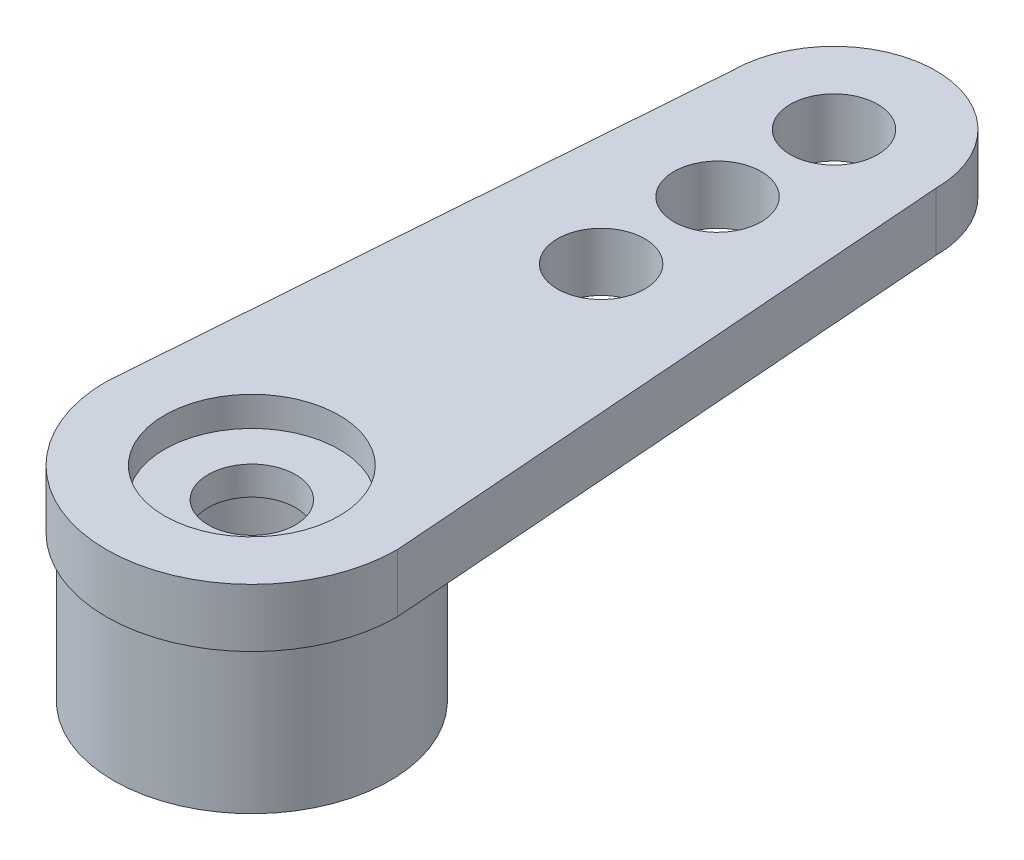
ISO-10303-21;
HEADER;
FILE_DESCRIPTION(('STEP AP214'),'2;1');
FILE_NAME('part.step','',(''),(''),'','','');
FILE_SCHEMA(('AUTOMOTIVE_DESIGN { 1 0 10303 214 1 1 1 1 }'));
ENDSEC;
DATA;
#1=APPLICATION_CONTEXT('core data for automotive mechanical design processes');
#2=APPLICATION_PROTOCOL_DEFINITION('international standard','automotive_design',2000,#1);
#3=PRODUCT_CONTEXT('',#1,'mechanical');
#4=PRODUCT('Part','Part','',(#3));
#5=PRODUCT_RELATED_PRODUCT_CATEGORY('part','',(#4));
#6=PRODUCT_DEFINITION_FORMATION('','',#4);
#7=PRODUCT_DEFINITION_CONTEXT('part definition',#1,'design');
#8=PRODUCT_DEFINITION('design','',#6,#7);
#9=PRODUCT_DEFINITION_SHAPE('','',#8);
#10=(LENGTH_UNIT() NAMED_UNIT(*) SI_UNIT(.MILLI.,.METRE.));
#11=(NAMED_UNIT(*) PLANE_ANGLE_UNIT() SI_UNIT($,.RADIAN.));
#12=(NAMED_UNIT(*) SI_UNIT($,.STERADIAN.) SOLID_ANGLE_UNIT());
#13=UNCERTAINTY_MEASURE_WITH_UNIT(LENGTH_MEASURE(1.E-05),#10,'distance_accuracy_value','');
#14=(GEOMETRIC_REPRESENTATION_CONTEXT(3) GLOBAL_UNCERTAINTY_ASSIGNED_CONTEXT((#13)) GLOBAL_UNIT_ASSIGNED_CONTEXT((#10,
#11,#12)) REPRESENTATION_CONTEXT('',''));
#15=CARTESIAN_POINT('',(0.,0.,0.));
#16=DIRECTION('',(0.,0.,1.));
#17=DIRECTION('',(1.,0.,0.));
#18=AXIS2_PLACEMENT_3D('',#15,#16,#17);
#19=CARTESIAN_POINT('',(0.,-5.,0.));
#20=DIRECTION('',(0.,1.,0.));
#21=DIRECTION('',(0.,0.,1.));
#22=AXIS2_PLACEMENT_3D('',#19,#20,#21);
#23=CYLINDRICAL_SURFACE('',#22,1.5);
#24=CARTESIAN_POINT('',(0.,0.984,0.));
#25=DIRECTION('',(0.,1.,0.));
#26=DIRECTION('',(0.,0.,1.));
#27=AXIS2_PLACEMENT_3D('',#24,#25,#26);
#28=CIRCLE('',#27,1.5);
#29=CARTESIAN_POINT('',(0.,0.984,1.5));
#30=VERTEX_POINT('',#29);
#31=EDGE_CURVE('E115',#30,#30,#28,.F.);
#32=ORIENTED_EDGE('',*,*,#31,.F.);
#33=EDGE_LOOP('',(#32));
#34=FACE_BOUND('',#33,.T.);
#35=CARTESIAN_POINT('',(0.,0.,0.));
#36=DIRECTION('',(0.,-1.,0.));
#37=DIRECTION('',(0.,0.,-1.));
#38=AXIS2_PLACEMENT_3D('',#35,#36,#37);
#39=CIRCLE('',#38,1.5);
#40=CARTESIAN_POINT('',(0.,0.,-1.5));
#41=VERTEX_POINT('',#40);
#42=EDGE_CURVE('E40',#41,#41,#39,.F.);
#43=ORIENTED_EDGE('',*,*,#42,.F.);
#44=EDGE_LOOP('',(#43));
#45=FACE_BOUND('',#44,.T.);
#46=ADVANCED_FACE('F36',(#34,#45),#23,.F.);
#47=CARTESIAN_POINT('',(0.,2.,0.));
#48=DIRECTION('',(0.,-1.,0.));
#49=DIRECTION('',(0.,0.,-1.));
#50=AXIS2_PLACEMENT_3D('',#47,#48,#49);
#51=CYLINDRICAL_SURFACE('',#50,5.);
#52=CARTESIAN_POINT('',(0.,0.,0.));
#53=DIRECTION('',(0.,1.,0.));
#54=DIRECTION('',(0.,0.,1.));
#55=AXIS2_PLACEMENT_3D('',#52,#53,#54);
#56=CIRCLE('',#55,5.);
#57=CARTESIAN_POINT('',(-5.,0.,0.));
#58=VERTEX_POINT('',#57);
#59=CARTESIAN_POINT('',(5.,0.,0.));
#60=VERTEX_POINT('',#59);
#61=EDGE_CURVE('E105',#58,#60,#56,.T.);
#62=ORIENTED_EDGE('',*,*,#61,.T.);
#63=DIRECTION('',(0.,-1.,0.));
#64=VECTOR('',#63,1.);
#65=CARTESIAN_POINT('',(5.,2.,0.));
#66=LINE('',#65,#64);
#67=CARTESIAN_POINT('',(5.,2.,0.));
#68=VERTEX_POINT('',#67);
#69=EDGE_CURVE('E46',#68,#60,#66,.T.);
#70=ORIENTED_EDGE('',*,*,#69,.F.);
#71=CARTESIAN_POINT('',(0.,2.,0.));
#72=DIRECTION('',(0.,1.,0.));
#73=DIRECTION('',(0.,0.,1.));
#74=AXIS2_PLACEMENT_3D('',#71,#72,#73);
#75=CIRCLE('',#74,5.);
#76=CARTESIAN_POINT('',(-5.,2.,0.));
#77=VERTEX_POINT('',#76);
#78=EDGE_CURVE('E91',#77,#68,#75,.T.);
#79=ORIENTED_EDGE('',*,*,#78,.F.);
#80=DIRECTION('',(0.,-1.,0.));
#81=VECTOR('',#80,1.);
#82=CARTESIAN_POINT('',(-5.,2.,0.));
#83=LINE('',#82,#81);
#84=EDGE_CURVE('E101',#77,#58,#83,.T.);
#85=ORIENTED_EDGE('',*,*,#84,.T.);
#86=EDGE_LOOP('',(#62,#70,#79,#85));
#87=FACE_BOUND('',#86,.T.);
#88=ADVANCED_FACE('F38',(#87),#51,.T.);
#89=CARTESIAN_POINT('',(3.5,2.,-20.));
#90=DIRECTION('',(-0.997199309888457,0.,0.0747899482416343));
#91=DIRECTION('',(0.0747899482416343,0.,0.997199309888457));
#92=AXIS2_PLACEMENT_3D('',#89,#90,#91);
#93=PLANE('',#92);
#94=DIRECTION('',(-0.0747899482416343,0.,-0.997199309888456));
#95=VECTOR('',#94,1.);
#96=CARTESIAN_POINT('',(3.5,0.,-20.));
#97=LINE('',#96,#95);
#98=CARTESIAN_POINT('',(3.5,0.,-20.));
#99=VERTEX_POINT('',#98);
#100=EDGE_CURVE('E96',#60,#99,#97,.T.);
#101=ORIENTED_EDGE('',*,*,#100,.T.);
#102=DIRECTION('',(0.,-1.,0.));
#103=VECTOR('',#102,1.);
#104=CARTESIAN_POINT('',(3.5,2.,-20.));
#105=LINE('',#104,#103);
#106=CARTESIAN_POINT('',(3.5,2.,-20.));
#107=VERTEX_POINT('',#106);
#108=EDGE_CURVE('E94',#107,#99,#105,.T.);
#109=ORIENTED_EDGE('',*,*,#108,.F.);
#110=DIRECTION('',(-0.0747899482416343,0.,-0.997199309888456));
#111=VECTOR('',#110,1.);
#112=CARTESIAN_POINT('',(3.5,2.,-20.));
#113=LINE('',#112,#111);
#114=EDGE_CURVE('E86',#68,#107,#113,.T.);
#115=ORIENTED_EDGE('',*,*,#114,.F.);
#116=ORIENTED_EDGE('',*,*,#69,.T.);
#117=EDGE_LOOP('',(#101,#109,#115,#116));
#118=FACE_BOUND('',#117,.T.);
#119=ADVANCED_FACE('F95',(#118),#93,.F.);
#120=CARTESIAN_POINT('',(0.,2.,-20.));
#121=DIRECTION('',(0.,-1.,0.));
#122=DIRECTION('',(0.,0.,-1.));
#123=AXIS2_PLACEMENT_3D('',#120,#121,#122);
#124=CYLINDRICAL_SURFACE('',#123,3.5);
#125=CARTESIAN_POINT('',(0.,0.,-20.));
#126=DIRECTION('',(0.,1.,0.));
#127=DIRECTION('',(0.,0.,1.));
#128=AXIS2_PLACEMENT_3D('',#125,#126,#127);
#129=CIRCLE('',#128,3.5);
#130=CARTESIAN_POINT('',(-3.5,0.,-20.));
#131=VERTEX_POINT('',#130);
#132=EDGE_CURVE('E72',#99,#131,#129,.T.);
#133=ORIENTED_EDGE('',*,*,#132,.T.);
#134=DIRECTION('',(0.,-1.,0.));
#135=VECTOR('',#134,1.);
#136=CARTESIAN_POINT('',(-3.5,2.,-20.));
#137=LINE('',#136,#135);
#138=CARTESIAN_POINT('',(-3.5,2.,-20.));
#139=VERTEX_POINT('',#138);
#140=EDGE_CURVE('E97',#139,#131,#137,.T.);
#141=ORIENTED_EDGE('',*,*,#140,.F.);
#142=CARTESIAN_POINT('',(0.,2.,-20.));
#143=DIRECTION('',(0.,1.,0.));
#144=DIRECTION('',(0.,0.,1.));
#145=AXIS2_PLACEMENT_3D('',#142,#143,#144);
#146=CIRCLE('',#145,3.5);
#147=EDGE_CURVE('E89',#107,#139,#146,.T.);
#148=ORIENTED_EDGE('',*,*,#147,.F.);
#149=ORIENTED_EDGE('',*,*,#108,.T.);
#150=EDGE_LOOP('',(#133,#141,#148,#149));
#151=FACE_BOUND('',#150,.T.);
#152=ADVANCED_FACE('F99',(#151),#124,.T.);
#153=CARTESIAN_POINT('',(-3.5,2.,-20.));
#154=DIRECTION('',(0.997199309888457,0.,0.0747899482416342));
#155=DIRECTION('',(0.0747899482416342,0.,-0.997199309888457));
#156=AXIS2_PLACEMENT_3D('',#153,#154,#155);
#157=PLANE('',#156);
#158=DIRECTION('',(-0.0747899482416342,0.,0.997199309888456));
#159=VECTOR('',#158,1.);
#160=CARTESIAN_POINT('',(-3.5,0.,-20.));
#161=LINE('',#160,#159);
#162=EDGE_CURVE('E78',#131,#58,#161,.T.);
#163=ORIENTED_EDGE('',*,*,#162,.T.);
#164=ORIENTED_EDGE('',*,*,#84,.F.);
#165=DIRECTION('',(-0.0747899482416342,0.,0.997199309888456));
#166=VECTOR('',#165,1.);
#167=CARTESIAN_POINT('',(-3.5,2.,-20.));
#168=LINE('',#167,#166);
#169=EDGE_CURVE('E55',#139,#77,#168,.T.);
#170=ORIENTED_EDGE('',*,*,#169,.F.);
#171=ORIENTED_EDGE('',*,*,#140,.T.);
#172=EDGE_LOOP('',(#163,#164,#170,#171));
#173=FACE_BOUND('',#172,.T.);
#174=ADVANCED_FACE('F157',(#173),#157,.F.);
#175=CARTESIAN_POINT('',(0.,2.,0.));
#176=DIRECTION('',(0.,1.,0.));
#177=DIRECTION('',(0.,0.,1.));
#178=AXIS2_PLACEMENT_3D('',#175,#176,#177);
#179=PLANE('',#178);
#180=CARTESIAN_POINT('',(0.,2.,-12.));
#181=DIRECTION('',(0.,1.,0.));
#182=DIRECTION('',(0.,0.,1.));
#183=AXIS2_PLACEMENT_3D('',#180,#181,#182);
#184=CIRCLE('',#183,1.5);
#185=CARTESIAN_POINT('',(0.,2.,-10.5));
#186=VERTEX_POINT('',#185);
#187=EDGE_CURVE('E126',#186,#186,#184,.T.);
#188=ORIENTED_EDGE('',*,*,#187,.F.);
#189=EDGE_LOOP('',(#188));
#190=FACE_BOUND('',#189,.T.);
#191=CARTESIAN_POINT('',(0.,2.,-16.));
#192=DIRECTION('',(0.,1.,0.));
#193=DIRECTION('',(0.,0.,1.));
#194=AXIS2_PLACEMENT_3D('',#191,#192,#193);
#195=CIRCLE('',#194,1.5);
#196=CARTESIAN_POINT('',(0.,2.,-14.5));
#197=VERTEX_POINT('',#196);
#198=EDGE_CURVE('E123',#197,#197,#195,.T.);
#199=ORIENTED_EDGE('',*,*,#198,.F.);
#200=EDGE_LOOP('',(#199));
#201=FACE_BOUND('',#200,.T.);
#202=CARTESIAN_POINT('',(0.,2.,0.));
#203=DIRECTION('',(0.,1.,0.));
#204=DIRECTION('',(0.,0.,1.));
#205=AXIS2_PLACEMENT_3D('',#202,#203,#204);
#206=CIRCLE('',#205,3.);
#207=CARTESIAN_POINT('',(0.,2.,3.));
#208=VERTEX_POINT('',#207);
#209=EDGE_CURVE('E122',#208,#208,#206,.T.);
#210=ORIENTED_EDGE('',*,*,#209,.F.);
#211=EDGE_LOOP('',(#210));
#212=FACE_BOUND('',#211,.T.);
#213=CARTESIAN_POINT('',(0.,2.,-20.));
#214=DIRECTION('',(0.,1.,0.));
#215=DIRECTION('',(0.,0.,1.));
#216=AXIS2_PLACEMENT_3D('',#213,#214,#215);
#217=CIRCLE('',#216,1.5);
#218=CARTESIAN_POINT('',(0.,2.,-18.5));
#219=VERTEX_POINT('',#218);
#220=EDGE_CURVE('E147',#219,#219,#217,.T.);
#221=ORIENTED_EDGE('',*,*,#220,.F.);
#222=EDGE_LOOP('',(#221));
#223=FACE_BOUND('',#222,.T.);
#224=ORIENTED_EDGE('',*,*,#78,.T.);
#225=ORIENTED_EDGE('',*,*,#114,.T.);
#226=ORIENTED_EDGE('',*,*,#147,.T.);
#227=ORIENTED_EDGE('',*,*,#169,.T.);
#228=EDGE_LOOP('',(#224,#225,#226,#227));
#229=FACE_BOUND('',#228,.T.);
#230=ADVANCED_FACE('F87',(#190,#201,#212,#223,#229),#179,.T.);
#231=CARTESIAN_POINT('',(0.,0.,0.));
#232=DIRECTION('',(0.,1.,0.));
#233=DIRECTION('',(0.,0.,1.));
#234=AXIS2_PLACEMENT_3D('',#231,#232,#233);
#235=PLANE('',#234);
#236=CARTESIAN_POINT('',(0.,0.,-12.));
#237=DIRECTION('',(0.,1.,0.));
#238=DIRECTION('',(0.,0.,1.));
#239=AXIS2_PLACEMENT_3D('',#236,#237,#238);
#240=CIRCLE('',#239,1.5);
#241=CARTESIAN_POINT('',(0.,0.,-10.5));
#242=VERTEX_POINT('',#241);
#243=EDGE_CURVE('E124',#242,#242,#240,.T.);
#244=ORIENTED_EDGE('',*,*,#243,.T.);
#245=EDGE_LOOP('',(#244));
#246=FACE_BOUND('',#245,.T.);
#247=CARTESIAN_POINT('',(0.,0.,-16.));
#248=DIRECTION('',(0.,1.,0.));
#249=DIRECTION('',(0.,0.,1.));
#250=AXIS2_PLACEMENT_3D('',#247,#248,#249);
#251=CIRCLE('',#250,1.5);
#252=CARTESIAN_POINT('',(0.,0.,-14.5));
#253=VERTEX_POINT('',#252);
#254=EDGE_CURVE('E120',#253,#253,#251,.T.);
#255=ORIENTED_EDGE('',*,*,#254,.T.);
#256=EDGE_LOOP('',(#255));
#257=FACE_BOUND('',#256,.T.);
#258=CARTESIAN_POINT('',(0.,0.,0.));
#259=DIRECTION('',(0.,1.,0.));
#260=DIRECTION('',(0.,0.,1.));
#261=AXIS2_PLACEMENT_3D('',#258,#259,#260);
#262=CIRCLE('',#261,4.75);
#263=CARTESIAN_POINT('',(0.,0.,4.75));
#264=VERTEX_POINT('',#263);
#265=EDGE_CURVE('E11',#264,#264,#262,.F.);
#266=ORIENTED_EDGE('',*,*,#265,.F.);
#267=EDGE_LOOP('',(#266));
#268=FACE_BOUND('',#267,.T.);
#269=CARTESIAN_POINT('',(0.,0.,-20.));
#270=DIRECTION('',(0.,1.,0.));
#271=DIRECTION('',(0.,0.,1.));
#272=AXIS2_PLACEMENT_3D('',#269,#270,#271);
#273=CIRCLE('',#272,1.5);
#274=CARTESIAN_POINT('',(0.,0.,-18.5));
#275=VERTEX_POINT('',#274);
#276=EDGE_CURVE('E108',#275,#275,#273,.T.);
#277=ORIENTED_EDGE('',*,*,#276,.T.);
#278=EDGE_LOOP('',(#277));
#279=FACE_BOUND('',#278,.T.);
#280=ORIENTED_EDGE('',*,*,#61,.F.);
#281=ORIENTED_EDGE('',*,*,#162,.F.);
#282=ORIENTED_EDGE('',*,*,#132,.F.);
#283=ORIENTED_EDGE('',*,*,#100,.F.);
#284=EDGE_LOOP('',(#280,#281,#282,#283));
#285=FACE_BOUND('',#284,.T.);
#286=ADVANCED_FACE('F156',(#246,#257,#268,#279,#285),#235,.F.);
#287=CARTESIAN_POINT('',(0.,0.,-20.));
#288=DIRECTION('',(0.,1.,0.));
#289=DIRECTION('',(0.,0.,1.));
#290=AXIS2_PLACEMENT_3D('',#287,#288,#289);
#291=CYLINDRICAL_SURFACE('',#290,1.5);
#292=ORIENTED_EDGE('',*,*,#276,.F.);
#293=EDGE_LOOP('',(#292));
#294=FACE_BOUND('',#293,.T.);
#295=ORIENTED_EDGE('',*,*,#220,.T.);
#296=EDGE_LOOP('',(#295));
#297=FACE_BOUND('',#296,.T.);
#298=ADVANCED_FACE('F153',(#294,#297),#291,.F.);
#299=CARTESIAN_POINT('',(0.,-5.,0.));
#300=DIRECTION('',(0.,1.,0.));
#301=DIRECTION('',(0.,0.,1.));
#302=AXIS2_PLACEMENT_3D('',#299,#300,#301);
#303=CYLINDRICAL_SURFACE('',#302,4.75);
#304=CARTESIAN_POINT('',(0.,-5.,0.));
#305=DIRECTION('',(0.,-1.,0.));
#306=DIRECTION('',(0.,0.,-1.));
#307=AXIS2_PLACEMENT_3D('',#304,#305,#306);
#308=CIRCLE('',#307,4.75);
#309=CARTESIAN_POINT('',(0.,-5.,-4.75));
#310=VERTEX_POINT('',#309);
#311=EDGE_CURVE('E118',#310,#310,#308,.T.);
#312=ORIENTED_EDGE('',*,*,#311,.F.);
#313=EDGE_LOOP('',(#312));
#314=FACE_BOUND('',#313,.T.);
#315=ORIENTED_EDGE('',*,*,#265,.T.);
#316=EDGE_LOOP('',(#315));
#317=FACE_BOUND('',#316,.T.);
#318=ADVANCED_FACE('F185',(#314,#317),#303,.T.);
#319=CARTESIAN_POINT('',(0.,-5.,0.));
#320=DIRECTION('',(0.,-1.,0.));
#321=DIRECTION('',(0.,0.,-1.));
#322=AXIS2_PLACEMENT_3D('',#319,#320,#321);
#323=PLANE('',#322);
#324=CARTESIAN_POINT('',(0.,-5.,0.));
#325=DIRECTION('',(0.,-1.,0.));
#326=DIRECTION('',(0.,0.,-1.));
#327=AXIS2_PLACEMENT_3D('',#324,#325,#326);
#328=CIRCLE('',#327,3.);
#329=CARTESIAN_POINT('',(0.,-5.,-3.));
#330=VERTEX_POINT('',#329);
#331=EDGE_CURVE('E138',#330,#330,#328,.T.);
#332=ORIENTED_EDGE('',*,*,#331,.F.);
#333=EDGE_LOOP('',(#332));
#334=FACE_BOUND('',#333,.T.);
#335=ORIENTED_EDGE('',*,*,#311,.T.);
#336=EDGE_LOOP('',(#335));
#337=FACE_BOUND('',#336,.T.);
#338=ADVANCED_FACE('F181',(#334,#337),#323,.T.);
#339=CARTESIAN_POINT('',(0.,0.984,0.));
#340=DIRECTION('',(0.,1.,0.));
#341=DIRECTION('',(0.,0.,1.));
#342=AXIS2_PLACEMENT_3D('',#339,#340,#341);
#343=PLANE('',#342);
#344=CARTESIAN_POINT('',(0.,0.984,0.));
#345=DIRECTION('',(0.,1.,0.));
#346=DIRECTION('',(0.,0.,1.));
#347=AXIS2_PLACEMENT_3D('',#344,#345,#346);
#348=CIRCLE('',#347,3.);
#349=CARTESIAN_POINT('',(0.,0.984,3.));
#350=VERTEX_POINT('',#349);
#351=EDGE_CURVE('E119',#350,#350,#348,.T.);
#352=ORIENTED_EDGE('',*,*,#351,.T.);
#353=EDGE_LOOP('',(#352));
#354=FACE_BOUND('',#353,.T.);
#355=ORIENTED_EDGE('',*,*,#31,.T.);
#356=EDGE_LOOP('',(#355));
#357=FACE_BOUND('',#356,.T.);
#358=ADVANCED_FACE('F184',(#354,#357),#343,.T.);
#359=CARTESIAN_POINT('',(0.,0.984,0.));
#360=DIRECTION('',(0.,1.,0.));
#361=DIRECTION('',(0.,0.,1.));
#362=AXIS2_PLACEMENT_3D('',#359,#360,#361);
#363=CYLINDRICAL_SURFACE('',#362,3.);
#364=ORIENTED_EDGE('',*,*,#351,.F.);
#365=EDGE_LOOP('',(#364));
#366=FACE_BOUND('',#365,.T.);
#367=ORIENTED_EDGE('',*,*,#209,.T.);
#368=EDGE_LOOP('',(#367));
#369=FACE_BOUND('',#368,.T.);
#370=ADVANCED_FACE('F179',(#366,#369),#363,.F.);
#371=CARTESIAN_POINT('',(0.,-5.,-16.));
#372=DIRECTION('',(0.,1.,0.));
#373=DIRECTION('',(0.,0.,1.));
#374=AXIS2_PLACEMENT_3D('',#371,#372,#373);
#375=CYLINDRICAL_SURFACE('',#374,1.5);
#376=ORIENTED_EDGE('',*,*,#198,.T.);
#377=EDGE_LOOP('',(#376));
#378=FACE_BOUND('',#377,.T.);
#379=ORIENTED_EDGE('',*,*,#254,.F.);
#380=EDGE_LOOP('',(#379));
#381=FACE_BOUND('',#380,.T.);
#382=ADVANCED_FACE('F221',(#378,#381),#375,.F.);
#383=CARTESIAN_POINT('',(0.,-5.,-12.));
#384=DIRECTION('',(0.,1.,0.));
#385=DIRECTION('',(0.,0.,1.));
#386=AXIS2_PLACEMENT_3D('',#383,#384,#385);
#387=CYLINDRICAL_SURFACE('',#386,1.5);
#388=ORIENTED_EDGE('',*,*,#187,.T.);
#389=EDGE_LOOP('',(#388));
#390=FACE_BOUND('',#389,.T.);
#391=ORIENTED_EDGE('',*,*,#243,.F.);
#392=EDGE_LOOP('',(#391));
#393=FACE_BOUND('',#392,.T.);
#394=ADVANCED_FACE('F228',(#390,#393),#387,.F.);
#395=CARTESIAN_POINT('',(0.,0.,0.));
#396=DIRECTION('',(0.,-1.,0.));
#397=DIRECTION('',(0.,0.,-1.));
#398=AXIS2_PLACEMENT_3D('',#395,#396,#397);
#399=PLANE('',#398);
#400=CARTESIAN_POINT('',(0.,0.,0.));
#401=DIRECTION('',(0.,-1.,0.));
#402=DIRECTION('',(0.,0.,-1.));
#403=AXIS2_PLACEMENT_3D('',#400,#401,#402);
#404=CIRCLE('',#403,3.);
#405=CARTESIAN_POINT('',(0.,0.,-3.));
#406=VERTEX_POINT('',#405);
#407=EDGE_CURVE('E136',#406,#406,#404,.T.);
#408=ORIENTED_EDGE('',*,*,#407,.T.);
#409=EDGE_LOOP('',(#408));
#410=FACE_BOUND('',#409,.T.);
#411=ORIENTED_EDGE('',*,*,#42,.T.);
#412=EDGE_LOOP('',(#411));
#413=FACE_BOUND('',#412,.T.);
#414=ADVANCED_FACE('F236',(#410,#413),#399,.T.);
#415=CARTESIAN_POINT('',(0.,0.,0.));
#416=DIRECTION('',(0.,-1.,0.));
#417=DIRECTION('',(0.,0.,-1.));
#418=AXIS2_PLACEMENT_3D('',#415,#416,#417);
#419=CYLINDRICAL_SURFACE('',#418,3.);
#420=ORIENTED_EDGE('',*,*,#407,.F.);
#421=EDGE_LOOP('',(#420));
#422=FACE_BOUND('',#421,.T.);
#423=ORIENTED_EDGE('',*,*,#331,.T.);
#424=EDGE_LOOP('',(#423));
#425=FACE_BOUND('',#424,.T.);
#426=ADVANCED_FACE('F242',(#422,#425),#419,.F.);
#427=CLOSED_SHELL('',(#46,#88,#119,#152,#174,#230,#286,#298,#318,#338,#358,#370,#382,#394,#414,#426));
#428=MANIFOLD_SOLID_BREP('B2',#427);
#429=ADVANCED_BREP_SHAPE_REPRESENTATION('',(#18,#428),#14);
#430=SHAPE_DEFINITION_REPRESENTATION(#9,#429);
ENDSEC;
END-ISO-10303-21;
